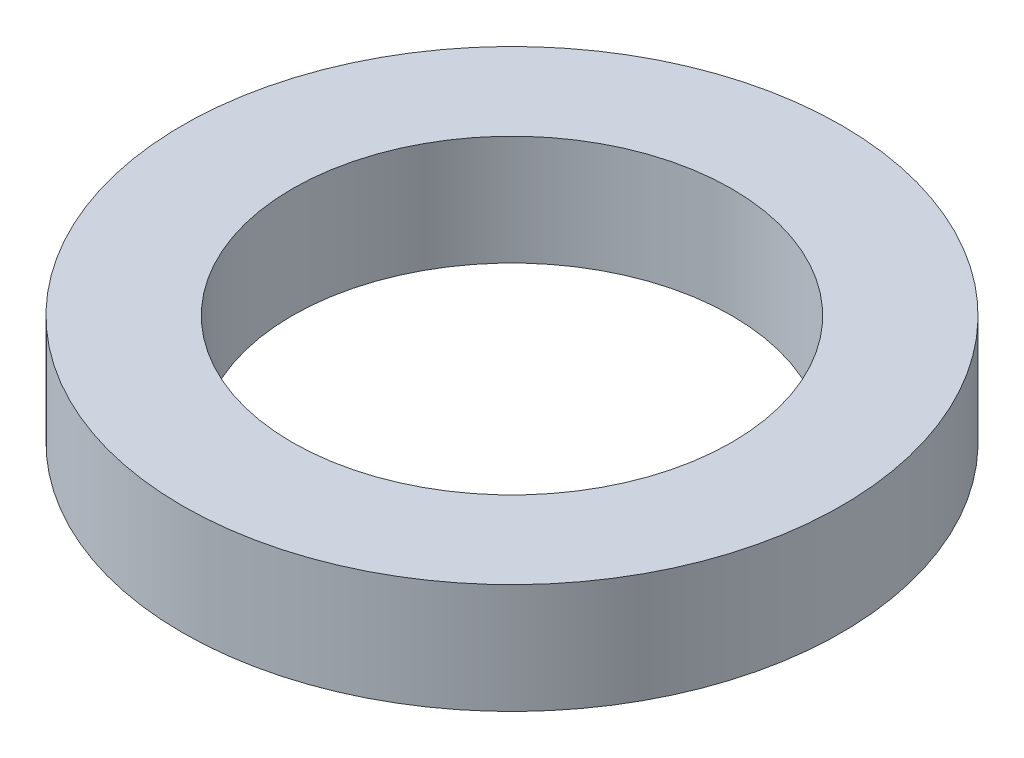
ISO-10303-21;
HEADER;
FILE_DESCRIPTION(('STEP AP214'),'2;1');
FILE_NAME('part.step','',(''),(''),'','','');
FILE_SCHEMA(('AUTOMOTIVE_DESIGN { 1 0 10303 214 1 1 1 1 }'));
ENDSEC;
DATA;
#1=APPLICATION_CONTEXT('core data for automotive mechanical design processes');
#2=APPLICATION_PROTOCOL_DEFINITION('international standard','automotive_design',2000,#1);
#3=PRODUCT_CONTEXT('',#1,'mechanical');
#4=PRODUCT('Part','Part','',(#3));
#5=PRODUCT_RELATED_PRODUCT_CATEGORY('part','',(#4));
#6=PRODUCT_DEFINITION_FORMATION('','',#4);
#7=PRODUCT_DEFINITION_CONTEXT('part definition',#1,'design');
#8=PRODUCT_DEFINITION('design','',#6,#7);
#9=PRODUCT_DEFINITION_SHAPE('','',#8);
#10=(LENGTH_UNIT() NAMED_UNIT(*) SI_UNIT(.MILLI.,.METRE.));
#11=(NAMED_UNIT(*) PLANE_ANGLE_UNIT() SI_UNIT($,.RADIAN.));
#12=(NAMED_UNIT(*) SI_UNIT($,.STERADIAN.) SOLID_ANGLE_UNIT());
#13=UNCERTAINTY_MEASURE_WITH_UNIT(LENGTH_MEASURE(1.E-05),#10,'distance_accuracy_value','');
#14=(GEOMETRIC_REPRESENTATION_CONTEXT(3) GLOBAL_UNCERTAINTY_ASSIGNED_CONTEXT((#13)) GLOBAL_UNIT_ASSIGNED_CONTEXT((#10,
#11,#12)) REPRESENTATION_CONTEXT('',''));
#15=CARTESIAN_POINT('',(0.,0.,0.));
#16=DIRECTION('',(0.,0.,1.));
#17=DIRECTION('',(1.,0.,0.));
#18=AXIS2_PLACEMENT_3D('',#15,#16,#17);
#19=CARTESIAN_POINT('',(0.,6.35,0.));
#20=DIRECTION('',(0.,1.,0.));
#21=DIRECTION('',(0.,0.,1.));
#22=AXIS2_PLACEMENT_3D('',#19,#20,#21);
#23=PLANE('',#22);
#24=CARTESIAN_POINT('',(0.,6.35,0.));
#25=DIRECTION('',(0.,1.,0.));
#26=DIRECTION('',(0.,0.,1.));
#27=AXIS2_PLACEMENT_3D('',#24,#25,#26);
#28=CIRCLE('',#27,19.05);
#29=CARTESIAN_POINT('',(0.,6.35,19.05));
#30=VERTEX_POINT('',#29);
#31=EDGE_CURVE('E10',#30,#30,#28,.T.);
#32=ORIENTED_EDGE('',*,*,#31,.T.);
#33=EDGE_LOOP('',(#32));
#34=FACE_BOUND('',#33,.T.);
#35=CARTESIAN_POINT('',(0.,6.35,0.));
#36=DIRECTION('',(0.,1.,0.));
#37=DIRECTION('',(0.,0.,1.));
#38=AXIS2_PLACEMENT_3D('',#35,#36,#37);
#39=CIRCLE('',#38,12.7);
#40=CARTESIAN_POINT('',(0.,6.35,12.7));
#41=VERTEX_POINT('',#40);
#42=EDGE_CURVE('E42',#41,#41,#39,.T.);
#43=ORIENTED_EDGE('',*,*,#42,.F.);
#44=EDGE_LOOP('',(#43));
#45=FACE_BOUND('',#44,.T.);
#46=ADVANCED_FACE('F31',(#34,#45),#23,.T.);
#47=CARTESIAN_POINT('',(0.,0.,0.));
#48=DIRECTION('',(0.,1.,0.));
#49=DIRECTION('',(0.,0.,1.));
#50=AXIS2_PLACEMENT_3D('',#47,#48,#49);
#51=PLANE('',#50);
#52=CARTESIAN_POINT('',(0.,0.,0.));
#53=DIRECTION('',(0.,1.,0.));
#54=DIRECTION('',(0.,0.,1.));
#55=AXIS2_PLACEMENT_3D('',#52,#53,#54);
#56=CIRCLE('',#55,19.05);
#57=CARTESIAN_POINT('',(0.,0.,19.05));
#58=VERTEX_POINT('',#57);
#59=EDGE_CURVE('E35',#58,#58,#56,.T.);
#60=ORIENTED_EDGE('',*,*,#59,.F.);
#61=EDGE_LOOP('',(#60));
#62=FACE_BOUND('',#61,.T.);
#63=CARTESIAN_POINT('',(0.,0.,0.));
#64=DIRECTION('',(0.,1.,0.));
#65=DIRECTION('',(0.,0.,1.));
#66=AXIS2_PLACEMENT_3D('',#63,#64,#65);
#67=CIRCLE('',#66,12.7);
#68=CARTESIAN_POINT('',(0.,0.,12.7));
#69=VERTEX_POINT('',#68);
#70=EDGE_CURVE('E44',#69,#69,#67,.T.);
#71=ORIENTED_EDGE('',*,*,#70,.T.);
#72=EDGE_LOOP('',(#71));
#73=FACE_BOUND('',#72,.T.);
#74=ADVANCED_FACE('F54',(#62,#73),#51,.F.);
#75=CARTESIAN_POINT('',(0.,6.35,0.));
#76=DIRECTION('',(0.,-1.,0.));
#77=DIRECTION('',(0.,0.,-1.));
#78=AXIS2_PLACEMENT_3D('',#75,#76,#77);
#79=CYLINDRICAL_SURFACE('',#78,19.05);
#80=ORIENTED_EDGE('',*,*,#31,.F.);
#81=EDGE_LOOP('',(#80));
#82=FACE_BOUND('',#81,.T.);
#83=ORIENTED_EDGE('',*,*,#59,.T.);
#84=EDGE_LOOP('',(#83));
#85=FACE_BOUND('',#84,.T.);
#86=ADVANCED_FACE('F33',(#82,#85),#79,.T.);
#87=CARTESIAN_POINT('',(0.,6.35,0.));
#88=DIRECTION('',(0.,-1.,0.));
#89=DIRECTION('',(0.,0.,-1.));
#90=AXIS2_PLACEMENT_3D('',#87,#88,#89);
#91=CYLINDRICAL_SURFACE('',#90,12.7);
#92=ORIENTED_EDGE('',*,*,#42,.T.);
#93=EDGE_LOOP('',(#92));
#94=FACE_BOUND('',#93,.T.);
#95=ORIENTED_EDGE('',*,*,#70,.F.);
#96=EDGE_LOOP('',(#95));
#97=FACE_BOUND('',#96,.T.);
#98=ADVANCED_FACE('F50',(#94,#97),#91,.F.);
#99=CLOSED_SHELL('',(#46,#74,#86,#98));
#100=MANIFOLD_SOLID_BREP('B2',#99);
#101=ADVANCED_BREP_SHAPE_REPRESENTATION('',(#18,#100),#14);
#102=SHAPE_DEFINITION_REPRESENTATION(#9,#101);
ENDSEC;
END-ISO-10303-21;
